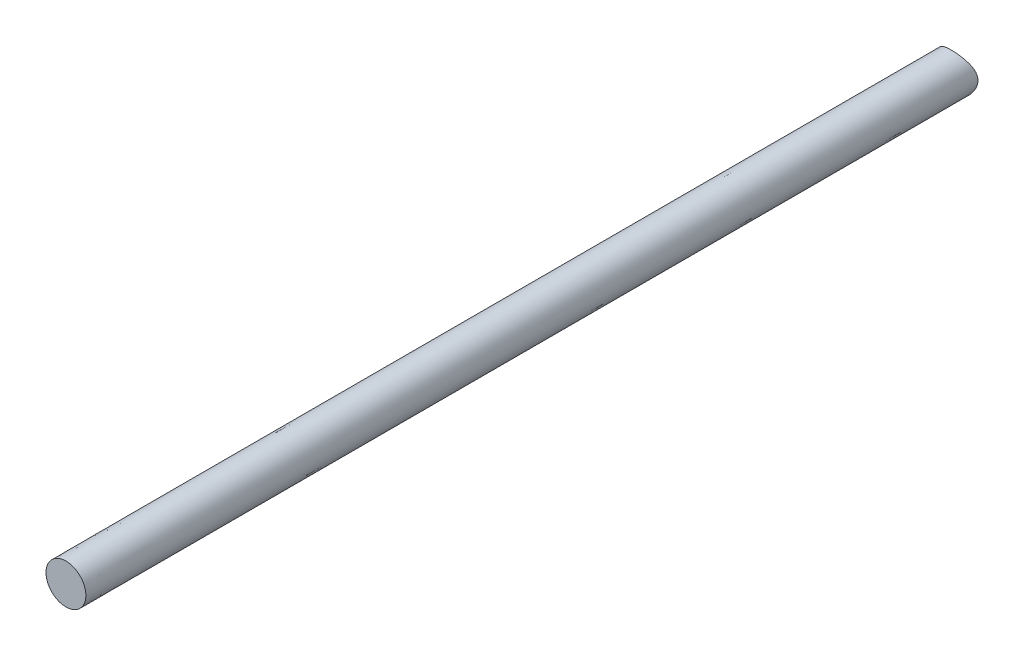
ISO-10303-21;
HEADER;
FILE_DESCRIPTION(('STEP AP214'),'2;1');
FILE_NAME('part.step','',(''),(''),'','','');
FILE_SCHEMA(('AUTOMOTIVE_DESIGN { 1 0 10303 214 1 1 1 1 }'));
ENDSEC;
DATA;
#1=APPLICATION_CONTEXT('core data for automotive mechanical design processes');
#2=APPLICATION_PROTOCOL_DEFINITION('international standard','automotive_design',2000,#1);
#3=PRODUCT_CONTEXT('',#1,'mechanical');
#4=PRODUCT('Part','Part','',(#3));
#5=PRODUCT_RELATED_PRODUCT_CATEGORY('part','',(#4));
#6=PRODUCT_DEFINITION_FORMATION('','',#4);
#7=PRODUCT_DEFINITION_CONTEXT('part definition',#1,'design');
#8=PRODUCT_DEFINITION('design','',#6,#7);
#9=PRODUCT_DEFINITION_SHAPE('','',#8);
#10=(LENGTH_UNIT() NAMED_UNIT(*) SI_UNIT(.MILLI.,.METRE.));
#11=(NAMED_UNIT(*) PLANE_ANGLE_UNIT() SI_UNIT($,.RADIAN.));
#12=(NAMED_UNIT(*) SI_UNIT($,.STERADIAN.) SOLID_ANGLE_UNIT());
#13=UNCERTAINTY_MEASURE_WITH_UNIT(LENGTH_MEASURE(1.E-05),#10,'distance_accuracy_value','');
#14=(GEOMETRIC_REPRESENTATION_CONTEXT(3) GLOBAL_UNCERTAINTY_ASSIGNED_CONTEXT((#13)) GLOBAL_UNIT_ASSIGNED_CONTEXT((#10,
#11,#12)) REPRESENTATION_CONTEXT('',''));
#15=CARTESIAN_POINT('',(0.,0.,0.));
#16=DIRECTION('',(0.,0.,1.));
#17=DIRECTION('',(1.,0.,0.));
#18=AXIS2_PLACEMENT_3D('',#15,#16,#17);
#19=CARTESIAN_POINT('',(5.,0.,-73.7550020012115));
#20=CARTESIAN_POINT('',(5.,1.36135533882743,-73.7550020012115));
#21=CARTESIAN_POINT('',(4.44105454755781,2.62385875962352,-73.2716446898054));
#22=CARTESIAN_POINT('',(2.65408033955451,4.42305978209963,-72.3875373088562));
#23=CARTESIAN_POINT('',(1.37318432350913,4.99414846205692,-72.0036571906576));
#24=CARTESIAN_POINT('',(-0.654380909724132,5.00285659766877,-71.998214636612));
#25=CARTESIAN_POINT('',(-1.32742626210144,4.86511538976397,-72.0862390291346));
#26=CARTESIAN_POINT('',(-2.53890330767727,4.35722138883259,-72.387927799975));
#27=CARTESIAN_POINT('',(-3.08109599130336,3.98867373983816,-72.6001624801419));
#28=CARTESIAN_POINT('',(-4.4291430014285,2.64449902909753,-73.2631102434217));
#29=CARTESIAN_POINT('',(-4.99408163219424,1.38001279825633,-73.7502635877939));
#30=CARTESIAN_POINT('',(-5.00582494996553,-1.33678840609641,-73.7596656226316));
#31=CARTESIAN_POINT('',(-4.45323693418821,-2.60815180593806,-73.2787149443401));
#32=CARTESIAN_POINT('',(-3.10471335371129,-3.97104504507262,-72.6099727343392));
#33=CARTESIAN_POINT('',(-2.57545011457876,-4.33650460507496,-72.3999149391093));
#34=CARTESIAN_POINT('',(-1.35822909188608,-4.85730678632454,-72.0911789778376));
#35=CARTESIAN_POINT('',(-0.697166135447588,-4.99726283855513,-72.0017107177364));
#36=CARTESIAN_POINT('',(0.657336314174032,-5.00265784039715,-71.9983388578011));
#37=CARTESIAN_POINT('',(1.32969849939458,-4.86445831498626,-72.0866463401946));
#38=CARTESIAN_POINT('',(2.54046518211495,-4.35627013120087,-72.3884757831241));
#39=CARTESIAN_POINT('',(3.08342318000934,-3.98755804305478,-72.600937494579));
#40=CARTESIAN_POINT('',(3.9869671509655,-3.08418718479793,-73.0460286595249));
#41=CARTESIAN_POINT('',(4.34744592353451,-2.55520602891143,-73.2770884491595));
#42=CARTESIAN_POINT('',(4.85905667492452,-1.34867792230524,-73.6370294666052));
#43=CARTESIAN_POINT('',(5.,-0.680677669413717,-73.7550020012115));
#44=CARTESIAN_POINT('',(5.,0.,-73.7550020012115));
#45=B_SPLINE_CURVE_WITH_KNOTS('',3,(#19,#20,#21,#22,#23,#24,#25,#26,#27,#28,#29,#30,#31,#32,#33,
#34,#35,#36,#37,#38,#39,#40,#41,#42,#43,#44),.UNSPECIFIED.,.T.,.F.,(4,2,2,2,2,2,2,2,2,2,2,2,4),
(0.,0.125,0.249999999999999,0.312499999999999,0.374999999999999,0.499999999999999,
0.624999999999999,0.687499999999999,0.749999999999999,0.812499999999999,0.875,0.9375,1.),.UNSPECIFIED.);
#46=DIRECTION('',(0.,0.,1.));
#47=VECTOR('',#46,1.);
#48=SURFACE_OF_LINEAR_EXTRUSION('',#45,#47);
#49=CARTESIAN_POINT('',(5.,0.,-73.7550020012115));
#50=CARTESIAN_POINT('',(5.,1.36135533882743,-73.7550020012115));
#51=CARTESIAN_POINT('',(4.44105454755781,2.62385875962352,-73.2716446898054));
#52=CARTESIAN_POINT('',(2.65408033955451,4.42305978209963,-72.3875373088562));
#53=CARTESIAN_POINT('',(1.37318432350913,4.99414846205692,-72.0036571906576));
#54=CARTESIAN_POINT('',(-0.654380909724132,5.00285659766877,-71.998214636612));
#55=CARTESIAN_POINT('',(-1.32742626210144,4.86511538976397,-72.0862390291346));
#56=CARTESIAN_POINT('',(-2.53890330767727,4.35722138883259,-72.387927799975));
#57=CARTESIAN_POINT('',(-3.08109599130336,3.98867373983816,-72.6001624801419));
#58=CARTESIAN_POINT('',(-4.4291430014285,2.64449902909753,-73.2631102434217));
#59=CARTESIAN_POINT('',(-4.99408163219424,1.38001279825633,-73.7502635877939));
#60=CARTESIAN_POINT('',(-5.00582494996553,-1.33678840609641,-73.7596656226316));
#61=CARTESIAN_POINT('',(-4.45323693418821,-2.60815180593806,-73.2787149443401));
#62=CARTESIAN_POINT('',(-3.10471335371129,-3.97104504507262,-72.6099727343392));
#63=CARTESIAN_POINT('',(-2.57545011457876,-4.33650460507496,-72.3999149391093));
#64=CARTESIAN_POINT('',(-1.35822909188608,-4.85730678632454,-72.0911789778376));
#65=CARTESIAN_POINT('',(-0.697166135447588,-4.99726283855513,-72.0017107177364));
#66=CARTESIAN_POINT('',(0.657336314174032,-5.00265784039715,-71.9983388578011));
#67=CARTESIAN_POINT('',(1.32969849939458,-4.86445831498626,-72.0866463401946));
#68=CARTESIAN_POINT('',(2.54046518211495,-4.35627013120087,-72.3884757831241));
#69=CARTESIAN_POINT('',(3.08342318000934,-3.98755804305478,-72.600937494579));
#70=CARTESIAN_POINT('',(3.9869671509655,-3.08418718479793,-73.0460286595249));
#71=CARTESIAN_POINT('',(4.34744592353451,-2.55520602891143,-73.2770884491595));
#72=CARTESIAN_POINT('',(4.85905667492452,-1.34867792230524,-73.6370294666052));
#73=CARTESIAN_POINT('',(5.,-0.680677669413717,-73.7550020012115));
#74=CARTESIAN_POINT('',(5.,0.,-73.7550020012115));
#75=B_SPLINE_CURVE_WITH_KNOTS('',3,(#49,#50,#51,#52,#53,#54,#55,#56,#57,#58,#59,#60,#61,#62,#63,
#64,#65,#66,#67,#68,#69,#70,#71,#72,#73,#74),.UNSPECIFIED.,.T.,.F.,(4,2,2,2,2,2,2,2,2,2,2,2,4),
(0.,0.125,0.249999999999999,0.312499999999999,0.374999999999999,0.499999999999999,
0.624999999999999,0.687499999999999,0.749999999999999,0.812499999999999,0.875,0.9375,1.),.UNSPECIFIED.);
#76=CARTESIAN_POINT('',(5.,0.,-73.7550020012115));
#77=VERTEX_POINT('',#76);
#78=EDGE_CURVE('E10',#77,#77,#75,.T.);
#79=ORIENTED_EDGE('',*,*,#78,.T.);
#80=EDGE_LOOP('',(#79));
#81=FACE_BOUND('',#80,.T.);
#82=CARTESIAN_POINT('',(5.,0.,150.));
#83=CARTESIAN_POINT('',(4.99998589865453,-0.140747669924285,150.));
#84=CARTESIAN_POINT('',(4.99396522138226,-0.281480333942581,150.));
#85=CARTESIAN_POINT('',(4.97007557179873,-0.561925796340753,150.));
#86=CARTESIAN_POINT('',(4.95220296889958,-0.701638268943655,150.));
#87=CARTESIAN_POINT('',(4.88102381806982,-1.11819562312444,150.));
#88=CARTESIAN_POINT('',(4.81015609363908,-1.39238686733671,150.));
#89=CARTESIAN_POINT('',(4.69359531999281,-1.72464458467474,150.));
#90=CARTESIAN_POINT('',(4.6688672821483,-1.79061313825796,150.));
#91=CARTESIAN_POINT('',(4.61661040080123,-1.92142744620208,150.));
#92=CARTESIAN_POINT('',(4.58908220787027,-1.98627345728957,150.));
#93=CARTESIAN_POINT('',(4.50250142194514,-2.17902773840344,150.));
#94=CARTESIAN_POINT('',(4.43944841995623,-2.30516415408439,150.));
#95=CARTESIAN_POINT('',(4.30286845208999,-2.55156729258637,150.));
#96=CARTESIAN_POINT('',(4.22934510912322,-2.67183602647617,150.));
#97=CARTESIAN_POINT('',(4.0722681957281,-2.90563755934959,150.));
#98=CARTESIAN_POINT('',(3.98871475688066,-3.01917044666898,150.));
#99=CARTESIAN_POINT('',(3.81284215466361,-3.23800109025384,150.));
#100=CARTESIAN_POINT('',(3.72058367559109,-3.34334769945678,150.));
#101=CARTESIAN_POINT('',(3.52768720578564,-3.54606942567558,150.));
#102=CARTESIAN_POINT('',(3.42704919635598,-3.64344452490414,150.));
#103=CARTESIAN_POINT('',(3.21791393575311,-3.82937807800291,150.));
#104=CARTESIAN_POINT('',(3.10941600205274,-3.91793576461191,150.));
#105=CARTESIAN_POINT('',(2.88540146714574,-4.08567967483348,150.));
#106=CARTESIAN_POINT('',(2.76988468568979,-4.16486565761951,150.));
#107=CARTESIAN_POINT('',(2.53168898473294,-4.31386911033921,150.));
#108=CARTESIAN_POINT('',(2.4089608044395,-4.38360784715655,150.));
#109=CARTESIAN_POINT('',(2.15806678184756,-4.51248933359973,150.));
#110=CARTESIAN_POINT('',(2.02990127061145,-4.57163272720155,150.));
#111=CARTESIAN_POINT('',(1.76895792936889,-4.67869241648271,150.));
#112=CARTESIAN_POINT('',(1.63617997695911,-4.72660841395161,150.));
#113=CARTESIAN_POINT('',(1.36705364372923,-4.81107248107574,150.));
#114=CARTESIAN_POINT('',(1.23070492829844,-4.84761948119725,150.));
#115=CARTESIAN_POINT('',(0.956050621974124,-4.90907481079986,150.));
#116=CARTESIAN_POINT('',(0.817756780663035,-4.93403542105422,150.));
#117=CARTESIAN_POINT('',(0.53963037660373,-4.9723647098427,150.));
#118=CARTESIAN_POINT('',(0.399797956843306,-4.98573445651154,150.));
#119=CARTESIAN_POINT('',(-0.0206800377142524,-5.00787163654593,150.));
#120=CARTESIAN_POINT('',(-0.302564991971944,-4.99872545485072,150.));
#121=CARTESIAN_POINT('',(-0.721128783991593,-4.94976448109277,150.));
#122=CARTESIAN_POINT('',(-0.860169116956873,-4.92750342726157,150.));
#123=CARTESIAN_POINT('',(-1.13585991769989,-4.8713331445819,150.));
#124=CARTESIAN_POINT('',(-1.27251147596577,-4.83742938478513,150.));
#125=CARTESIAN_POINT('',(-1.5425465951548,-4.75820451207996,150.));
#126=CARTESIAN_POINT('',(-1.67592839597768,-4.71287739193084,150.));
#127=CARTESIAN_POINT('',(-1.87271788543006,-4.6365755807017,150.));
#128=CARTESIAN_POINT('',(-1.93776353172456,-4.60975823721919,150.));
#129=CARTESIAN_POINT('',(-2.06669291724148,-4.55345560269863,150.));
#130=CARTESIAN_POINT('',(-2.13057658995992,-4.52397015952903,150.));
#131=CARTESIAN_POINT('',(-2.32055296226458,-4.43141723092996,150.));
#132=CARTESIAN_POINT('',(-2.44472792850332,-4.3643473519532,150.));
#133=CARTESIAN_POINT('',(-2.68686478268023,-4.21985028308982,150.));
#134=CARTESIAN_POINT('',(-2.80482706995984,-4.1424237600476,150.));
#135=CARTESIAN_POINT('',(-3.03367276451732,-3.97775192091558,150.));
#136=CARTESIAN_POINT('',(-3.14455781805966,-3.89050890142333,150.));
#137=CARTESIAN_POINT('',(-3.30501894566397,-3.75286751834332,150.));
#138=CARTESIAN_POINT('',(-3.35753500267588,-3.70585071253974,150.));
#139=CARTESIAN_POINT('',(-3.46057763395806,-3.6096786373449,150.));
#140=CARTESIAN_POINT('',(-3.51110420765768,-3.56052336734027,150.));
#141=CARTESIAN_POINT('',(-3.6097563921063,-3.46039818171928,150.));
#142=CARTESIAN_POINT('',(-3.65789383436369,-3.40943993180137,150.));
#143=CARTESIAN_POINT('',(-3.75193601016425,-3.30551000336502,150.));
#144=CARTESIAN_POINT('',(-3.79784077312658,-3.2525383513928,150.));
#145=CARTESIAN_POINT('',(-3.93212157808735,-3.09079021889502,150.));
#146=CARTESIAN_POINT('',(-4.01709072689498,-2.97915354160989,150.));
#147=CARTESIAN_POINT('',(-4.17738889495565,-2.74913234136183,150.));
#148=CARTESIAN_POINT('',(-4.25271542993627,-2.63074609078359,150.));
#149=CARTESIAN_POINT('',(-4.3932414936952,-2.38814002171022,150.));
#150=CARTESIAN_POINT('',(-4.45844057831714,-2.26391994767392,150.));
#151=CARTESIAN_POINT('',(-4.6383842876361,-1.88329629420092,150.));
#152=CARTESIAN_POINT('',(-4.73730486614512,-1.61917457990509,150.));
#153=CARTESIAN_POINT('',(-4.88952555930518,-1.07829854987061,150.));
#154=CARTESIAN_POINT('',(-4.94283816760588,-0.801547715593742,150.));
#155=CARTESIAN_POINT('',(-5.00210300353582,-0.241800138181681,150.));
#156=CARTESIAN_POINT('',(-5.00785866728148,0.0412176846981533,150.));
#157=CARTESIAN_POINT('',(-4.9711045957777,0.604132844491063,150.));
#158=CARTESIAN_POINT('',(-4.92858793903324,0.88402972809874,150.));
#159=CARTESIAN_POINT('',(-4.79779572607226,1.42965984007408,150.));
#160=CARTESIAN_POINT('',(-4.71001488065384,1.69551261318196,150.));
#161=CARTESIAN_POINT('',(-4.49177847505641,2.20925138584219,150.));
#162=CARTESIAN_POINT('',(-4.36132107502953,2.45713661022464,150.));
#163=CARTESIAN_POINT('',(-4.1352046488467,2.81199914789613,150.));
#164=CARTESIAN_POINT('',(-4.05393227921607,2.92837780824553,150.));
#165=CARTESIAN_POINT('',(-3.88177209561399,3.15383679189181,150.));
#166=CARTESIAN_POINT('',(-3.79088487047158,3.26291756145602,150.));
#167=CARTESIAN_POINT('',(-3.60000631123276,3.47275650596354,150.));
#168=CARTESIAN_POINT('',(-3.50001638896328,3.57351596693281,150.));
#169=CARTESIAN_POINT('',(-3.29179410762408,3.76612541350156,150.));
#170=CARTESIAN_POINT('',(-3.18356148459424,3.85797511356499,150.));
#171=CARTESIAN_POINT('',(-2.96127121625901,4.0309635963144,150.));
#172=CARTESIAN_POINT('',(-2.84731592246576,4.11223394985572,150.));
#173=CARTESIAN_POINT('',(-2.6130773264912,4.2649385540164,150.));
#174=CARTESIAN_POINT('',(-2.49279707445725,4.33637748669671,150.));
#175=CARTESIAN_POINT('',(-2.24659429003189,4.46898587757009,150.));
#176=CARTESIAN_POINT('',(-2.12066864903124,4.53014958753499,150.));
#177=CARTESIAN_POINT('',(-1.92827820665563,4.61374327686768,150.));
#178=CARTESIAN_POINT('',(-1.86355897636686,4.64025102279546,150.));
#179=CARTESIAN_POINT('',(-1.73304135679152,4.69047043583621,150.));
#180=CARTESIAN_POINT('',(-1.66724289954824,4.71418192609883,150.));
#181=CARTESIAN_POINT('',(-1.46811057880759,4.78124703395244,150.));
#182=CARTESIAN_POINT('',(-1.33333090642223,4.82040513174648,150.));
#183=CARTESIAN_POINT('',(-1.06105196477278,4.88740254200991,150.));
#184=CARTESIAN_POINT('',(-0.923552403467082,4.9152406320265,150.));
#185=CARTESIAN_POINT('',(-0.508358310865919,4.98147886791893,150.));
#186=CARTESIAN_POINT('',(-0.227595575269967,5.00272788079673,150.));
#187=CARTESIAN_POINT('',(0.193577343419694,4.99820701177389,150.));
#188=CARTESIAN_POINT('',(0.334445340922897,4.99054682133532,150.));
#189=CARTESIAN_POINT('',(0.615025701406627,4.96315154098169,150.));
#190=CARTESIAN_POINT('',(0.75473795387277,4.94341530955731,150.));
#191=CARTESIAN_POINT('',(1.17068130369487,4.86651580831121,150.));
#192=CARTESIAN_POINT('',(1.44381249082308,4.79166040088063,150.));
#193=CARTESIAN_POINT('',(1.97172657569029,4.59866077846649,150.));
#194=CARTESIAN_POINT('',(2.22664205369488,4.48087813779323,150.));
#195=CARTESIAN_POINT('',(2.59172792736548,4.27430156725804,150.));
#196=CARTESIAN_POINT('',(2.71055704573185,4.20044680985519,150.));
#197=CARTESIAN_POINT('',(2.9416857201607,4.04309815334733,150.));
#198=CARTESIAN_POINT('',(3.05398568997158,3.95960486603369,150.));
#199=CARTESIAN_POINT('',(3.27325508368581,3.7816360776419,150.));
#200=CARTESIAN_POINT('',(3.38007444317644,3.68697547443797,150.));
#201=CARTESIAN_POINT('',(3.58487695995535,3.48852894785281,150.));
#202=CARTESIAN_POINT('',(3.68285966812736,3.38474256118924,150.));
#203=CARTESIAN_POINT('',(3.86958719904656,3.16906751589143,150.));
#204=CARTESIAN_POINT('',(3.9583267795626,3.0571743198246,150.));
#205=CARTESIAN_POINT('',(4.12591077564454,2.82625137087728,150.));
#206=CARTESIAN_POINT('',(4.20475523655502,2.70722165070374,150.));
#207=CARTESIAN_POINT('',(4.42173932395272,2.34730350764753,150.));
#208=CARTESIAN_POINT('',(4.54551235934014,2.09754414954503,150.));
#209=CARTESIAN_POINT('',(4.75007487051457,1.58142265003912,150.));
#210=CARTESIAN_POINT('',(4.83092417883052,1.31508420072782,150.));
#211=CARTESIAN_POINT('',(4.92592624665913,0.872616757243819,150.));
#212=CARTESIAN_POINT('',(4.9536702270549,0.699298393315443,150.));
#213=CARTESIAN_POINT('',(4.99071624714645,0.350645645120436,150.));
#214=CARTESIAN_POINT('',(5.00001756422359,0.175311182129927,150.));
#215=CARTESIAN_POINT('',(5.,0.,150.));
#216=B_SPLINE_CURVE_WITH_KNOTS('',3,(#82,#83,#84,#85,#86,#87,#88,#89,#90,#91,#92,#93,#94,#95,
#96,#97,#98,#99,#100,#101,#102,#103,#104,#105,#106,#107,#108,#109,#110,#111,#112,#113,#114,#115,
#116,#117,#118,#119,#120,#121,#122,#123,#124,#125,#126,#127,#128,#129,#130,#131,#132,#133,#134,
#135,#136,#137,#138,#139,#140,#141,#142,#143,#144,#145,#146,#147,#148,#149,#150,#151,#152,#153,
#154,#155,#156,#157,#158,#159,#160,#161,#162,#163,#164,#165,#166,#167,#168,#169,#170,#171,#172,
#173,#174,#175,#176,#177,#178,#179,#180,#181,#182,#183,#184,#185,#186,#187,#188,#189,#190,#191,
#192,#193,#194,#195,#196,#197,#198,#199,#200,#201,#202,#203,#204,#205,#206,#207,#208,#209,#210,
#211,#212,#213,#214,#215),.UNSPECIFIED.,.T.,.F.,(4,2,2,2,2,2,2,2,2,2,2,2,2,2,2,2,2,2,2,2,2,2,2,
2,2,2,2,2,2,2,2,2,2,2,2,2,2,2,2,2,2,2,2,2,2,2,2,2,2,2,2,2,2,2,2,2,2,2,2,2,2,2,2,2,2,2,4),(0.,
0.42206463533052,0.844258621037468,1.68886478123688,1.90019414353554,2.11147451847238,
2.53399753431856,2.95637470387145,3.378746333028,3.79836496133686,4.21798452594051,
4.6376405725564,5.05730740081629,5.48028089649433,5.90322867547317,6.32618768707898,
6.74918647635457,7.17025757426992,7.5912898650261,8.43256869731194,8.85462673446655,
9.2764867844078,9.69856914390924,9.90958604165992,10.1206149789101,10.5434525327996,
10.966262874086,11.3889745025472,11.600387944628,11.8118014473483,12.0220344167005,
12.2322646151424,12.6526116520692,13.0730667679729,13.4935403184404,14.3353726092733,
15.1769742183068,16.0220526308258,16.867252229663,17.7034041570107,18.5395921368264,
18.965016009327,19.3904138432594,19.8157458100977,20.2410914032853,20.6605019773932,
21.0797121173978,21.4991559991562,21.7089121455832,21.9186815510175,22.339169291163,
22.7597024279198,23.5996024343892,24.0223964125462,24.4452303622343,25.2906214414134,
26.1290504469945,26.5483795287827,26.9676820088997,27.3953078300739,27.8229553727811,
28.2508441496844,28.6787309657077,29.5109252636268,30.341956477619,30.8676472488617,
31.3933586172618),.UNSPECIFIED.);
#217=CARTESIAN_POINT('',(5.,0.,150.));
#218=VERTEX_POINT('',#217);
#219=EDGE_CURVE('E40',#218,#218,#216,.T.);
#220=ORIENTED_EDGE('',*,*,#219,.T.);
#221=EDGE_LOOP('',(#220));
#222=FACE_BOUND('',#221,.T.);
#223=ADVANCED_FACE('F35',(#81,#222),#48,.T.);
#224=CARTESIAN_POINT('',(4.87276754507804E-10,-37.2587522424124,-80.));
#225=DIRECTION('',(0.,1.,0.));
#226=DIRECTION('',(1.,0.,0.));
#227=AXIS2_PLACEMENT_3D('',#224,#225,#226);
#228=CYLINDRICAL_SURFACE('',#227,8.);
#229=ORIENTED_EDGE('',*,*,#78,.F.);
#230=EDGE_LOOP('',(#229));
#231=FACE_BOUND('',#230,.T.);
#232=ADVANCED_FACE('F37',(#231),#228,.F.);
#233=CARTESIAN_POINT('',(0.,0.,150.));
#234=DIRECTION('',(0.,0.,1.));
#235=DIRECTION('',(1.,0.,0.));
#236=AXIS2_PLACEMENT_3D('',#233,#234,#235);
#237=PLANE('',#236);
#238=ORIENTED_EDGE('',*,*,#219,.F.);
#239=EDGE_LOOP('',(#238));
#240=FACE_BOUND('',#239,.T.);
#241=ADVANCED_FACE('F55',(#240),#237,.T.);
#242=CLOSED_SHELL('',(#223,#232,#241));
#243=MANIFOLD_SOLID_BREP('B2',#242);
#244=ADVANCED_BREP_SHAPE_REPRESENTATION('',(#18,#243),#14);
#245=SHAPE_DEFINITION_REPRESENTATION(#9,#244);
ENDSEC;
END-ISO-10303-21;
